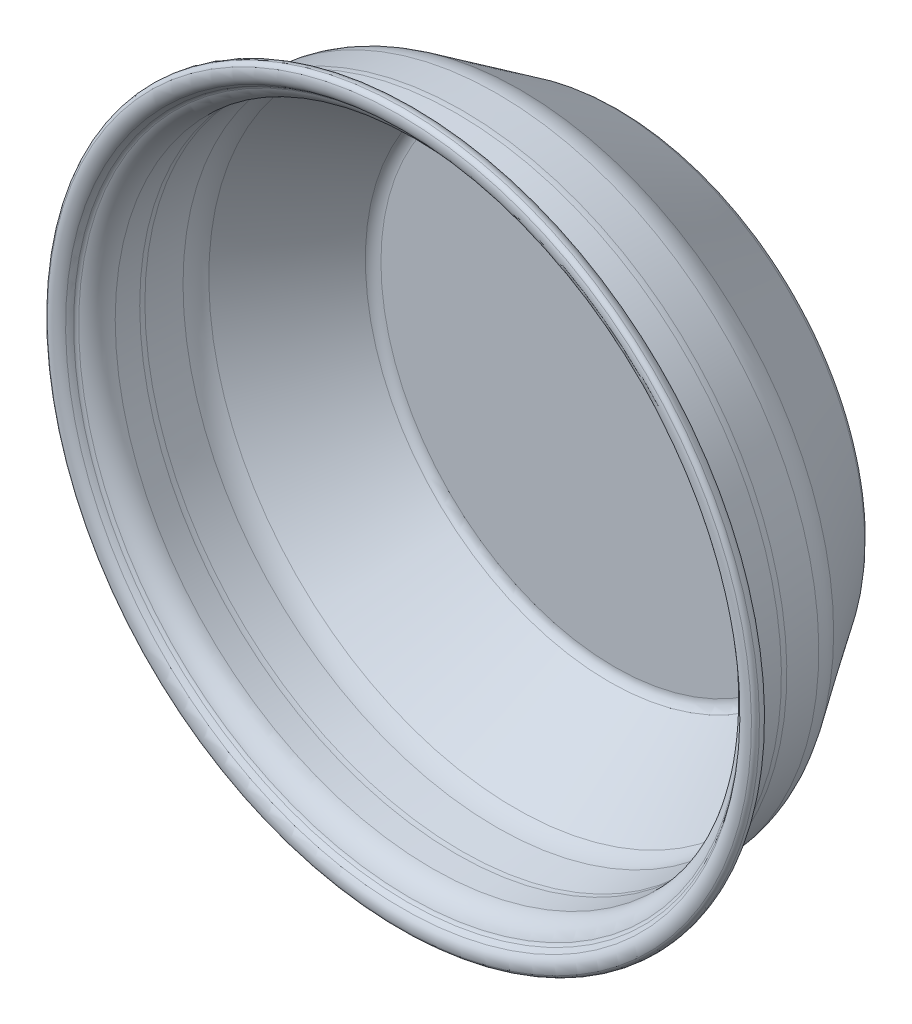
ISO-10303-21;
HEADER;
FILE_DESCRIPTION(('STEP AP214'),'2;1');
FILE_NAME('part.step','',(''),(''),'','','');
FILE_SCHEMA(('AUTOMOTIVE_DESIGN { 1 0 10303 214 1 1 1 1 }'));
ENDSEC;
DATA;
#1=APPLICATION_CONTEXT('core data for automotive mechanical design processes');
#2=APPLICATION_PROTOCOL_DEFINITION('international standard','automotive_design',2000,#1);
#3=PRODUCT_CONTEXT('',#1,'mechanical');
#4=PRODUCT('Part','Part','',(#3));
#5=PRODUCT_RELATED_PRODUCT_CATEGORY('part','',(#4));
#6=PRODUCT_DEFINITION_FORMATION('','',#4);
#7=PRODUCT_DEFINITION_CONTEXT('part definition',#1,'design');
#8=PRODUCT_DEFINITION('design','',#6,#7);
#9=PRODUCT_DEFINITION_SHAPE('','',#8);
#10=(LENGTH_UNIT() NAMED_UNIT(*) SI_UNIT(.MILLI.,.METRE.));
#11=(NAMED_UNIT(*) PLANE_ANGLE_UNIT() SI_UNIT($,.RADIAN.));
#12=(NAMED_UNIT(*) SI_UNIT($,.STERADIAN.) SOLID_ANGLE_UNIT());
#13=UNCERTAINTY_MEASURE_WITH_UNIT(LENGTH_MEASURE(1.E-05),#10,'distance_accuracy_value','');
#14=(GEOMETRIC_REPRESENTATION_CONTEXT(3) GLOBAL_UNCERTAINTY_ASSIGNED_CONTEXT((#13)) GLOBAL_UNIT_ASSIGNED_CONTEXT((#10,
#11,#12)) REPRESENTATION_CONTEXT('',''));
#15=CARTESIAN_POINT('',(0.,0.,0.));
#16=DIRECTION('',(0.,0.,1.));
#17=DIRECTION('',(1.,0.,0.));
#18=AXIS2_PLACEMENT_3D('',#15,#16,#17);
#19=CARTESIAN_POINT('',(0.,0.,0.));
#20=DIRECTION('',(0.,0.,-1.));
#21=DIRECTION('',(0.,1.,0.));
#22=AXIS2_PLACEMENT_3D('',#19,#20,#21);
#23=PLANE('',#22);
#24=CARTESIAN_POINT('',(0.,0.,0.));
#25=DIRECTION('',(0.,0.,-1.));
#26=DIRECTION('',(0.,1.,0.));
#27=AXIS2_PLACEMENT_3D('',#24,#25,#26);
#28=CIRCLE('',#27,91.186);
#29=CARTESIAN_POINT('',(0.,91.186,0.));
#30=VERTEX_POINT('',#29);
#31=EDGE_CURVE('E10',#30,#30,#28,.T.);
#32=ORIENTED_EDGE('',*,*,#31,.T.);
#33=EDGE_LOOP('',(#32));
#34=FACE_BOUND('',#33,.T.);
#35=ADVANCED_FACE('F37',(#34),#23,.T.);
#36=CARTESIAN_POINT('',(0.,0.,7.93749999999999));
#37=DIRECTION('',(0.,0.,-1.));
#38=DIRECTION('',(0.,1.,0.));
#39=AXIS2_PLACEMENT_3D('',#36,#37,#38);
#40=TOROIDAL_SURFACE('',#39,91.186,7.9375);
#41=CARTESIAN_POINT('',(0.,0.,3.52381443996187));
#42=DIRECTION('',(0.,0.,-1.));
#43=DIRECTION('',(0.,1.,0.));
#44=AXIS2_PLACEMENT_3D('',#41,#42,#43);
#45=CIRCLE('',#44,97.7832180521119);
#46=CARTESIAN_POINT('',(0.,97.7832180521119,3.52381443996189));
#47=VERTEX_POINT('',#46);
#48=EDGE_CURVE('E43',#47,#47,#45,.T.);
#49=ORIENTED_EDGE('',*,*,#48,.T.);
#50=EDGE_LOOP('',(#49));
#51=FACE_BOUND('',#50,.T.);
#52=ORIENTED_EDGE('',*,*,#31,.F.);
#53=EDGE_LOOP('',(#52));
#54=FACE_BOUND('',#53,.T.);
#55=ADVANCED_FACE('F117',(#51,#54),#40,.T.);
#56=CARTESIAN_POINT('',(0.,0.,3.52381443996187));
#57=DIRECTION('',(0.,0.,1.));
#58=DIRECTION('',(0.,-1.,0.));
#59=AXIS2_PLACEMENT_3D('',#56,#57,#58);
#60=CONICAL_SURFACE('',#59,97.7832180521119,0.589631608525966);
#61=CARTESIAN_POINT('',(0.,0.,40.0894715552513));
#62=DIRECTION('',(0.,0.,-1.));
#63=DIRECTION('',(0.,1.,0.));
#64=AXIS2_PLACEMENT_3D('',#61,#62,#63);
#65=CIRCLE('',#64,122.246455666548);
#66=CARTESIAN_POINT('',(0.,122.246455666548,40.0894715552513));
#67=VERTEX_POINT('',#66);
#68=EDGE_CURVE('E47',#67,#67,#65,.T.);
#69=ORIENTED_EDGE('',*,*,#68,.T.);
#70=EDGE_LOOP('',(#69));
#71=FACE_BOUND('',#70,.T.);
#72=ORIENTED_EDGE('',*,*,#48,.F.);
#73=EDGE_LOOP('',(#72));
#74=FACE_BOUND('',#73,.T.);
#75=ADVANCED_FACE('F121',(#71,#74),#60,.T.);
#76=CARTESIAN_POINT('',(0.,0.,50.6823168993428));
#77=DIRECTION('',(0.,0.,-1.));
#78=DIRECTION('',(0.,1.,0.));
#79=AXIS2_PLACEMENT_3D('',#76,#77,#78);
#80=TOROIDAL_SURFACE('',#79,106.413132341479,19.05);
#81=CARTESIAN_POINT('',(0.,0.,49.022));
#82=DIRECTION('',(0.,0.,-1.));
#83=DIRECTION('',(0.,1.,0.));
#84=AXIS2_PLACEMENT_3D('',#81,#82,#83);
#85=CIRCLE('',#84,125.390641340127);
#86=CARTESIAN_POINT('',(0.,125.390641340127,49.022));
#87=VERTEX_POINT('',#86);
#88=EDGE_CURVE('E51',#87,#87,#85,.T.);
#89=ORIENTED_EDGE('',*,*,#88,.T.);
#90=EDGE_LOOP('',(#89));
#91=FACE_BOUND('',#90,.T.);
#92=ORIENTED_EDGE('',*,*,#68,.F.);
#93=EDGE_LOOP('',(#92));
#94=FACE_BOUND('',#93,.T.);
#95=ADVANCED_FACE('F125',(#91,#94),#80,.T.);
#96=CARTESIAN_POINT('',(0.,0.,49.022));
#97=DIRECTION('',(0.,0.,1.));
#98=DIRECTION('',(0.,-1.,0.));
#99=AXIS2_PLACEMENT_3D('',#96,#97,#98);
#100=CONICAL_SURFACE('',#99,125.390641340127,0.0872664625997091);
#101=CARTESIAN_POINT('',(0.,0.,62.6832441342097));
#102=DIRECTION('',(0.,0.,-1.));
#103=DIRECTION('',(0.,1.,0.));
#104=AXIS2_PLACEMENT_3D('',#101,#102,#103);
#105=CIRCLE('',#104,126.58584533153);
#106=CARTESIAN_POINT('',(0.,126.58584533153,62.6832441342097));
#107=VERTEX_POINT('',#106);
#108=EDGE_CURVE('E56',#107,#107,#105,.T.);
#109=ORIENTED_EDGE('',*,*,#108,.T.);
#110=EDGE_LOOP('',(#109));
#111=FACE_BOUND('',#110,.T.);
#112=ORIENTED_EDGE('',*,*,#88,.F.);
#113=EDGE_LOOP('',(#112));
#114=FACE_BOUND('',#113,.T.);
#115=ADVANCED_FACE('F132',(#111,#114),#100,.T.);
#116=CARTESIAN_POINT('',(0.,0.,64.897));
#117=DIRECTION('',(0.,0.,-1.));
#118=DIRECTION('',(0.,1.,0.));
#119=AXIS2_PLACEMENT_3D('',#116,#117,#118);
#120=TOROIDAL_SURFACE('',#119,101.2825,25.4);
#121=CARTESIAN_POINT('',(0.,0.,64.897));
#122=DIRECTION('',(0.,0.,-1.));
#123=DIRECTION('',(0.,1.,0.));
#124=AXIS2_PLACEMENT_3D('',#121,#122,#123);
#125=CIRCLE('',#124,126.6825);
#126=CARTESIAN_POINT('',(0.,126.6825,64.897));
#127=VERTEX_POINT('',#126);
#128=EDGE_CURVE('E59',#127,#127,#125,.T.);
#129=ORIENTED_EDGE('',*,*,#128,.T.);
#130=EDGE_LOOP('',(#129));
#131=FACE_BOUND('',#130,.T.);
#132=ORIENTED_EDGE('',*,*,#108,.F.);
#133=EDGE_LOOP('',(#132));
#134=FACE_BOUND('',#133,.T.);
#135=ADVANCED_FACE('F136',(#131,#134),#120,.T.);
#136=CARTESIAN_POINT('',(0.,0.,0.));
#137=DIRECTION('',(0.,0.,-1.));
#138=DIRECTION('',(0.,1.,0.));
#139=AXIS2_PLACEMENT_3D('',#136,#137,#138);
#140=CYLINDRICAL_SURFACE('',#139,126.6825);
#141=CARTESIAN_POINT('',(0.,0.,74.453829774373));
#142=DIRECTION('',(0.,0.,-1.));
#143=DIRECTION('',(0.,1.,0.));
#144=AXIS2_PLACEMENT_3D('',#141,#142,#143);
#145=CIRCLE('',#144,126.6825);
#146=CARTESIAN_POINT('',(0.,126.6825,74.453829774373));
#147=VERTEX_POINT('',#146);
#148=EDGE_CURVE('E62',#147,#147,#145,.T.);
#149=ORIENTED_EDGE('',*,*,#148,.T.);
#150=EDGE_LOOP('',(#149));
#151=FACE_BOUND('',#150,.T.);
#152=ORIENTED_EDGE('',*,*,#128,.F.);
#153=EDGE_LOOP('',(#152));
#154=FACE_BOUND('',#153,.T.);
#155=ADVANCED_FACE('F140',(#151,#154),#140,.T.);
#156=CARTESIAN_POINT('',(0.,0.,74.453829774373));
#157=DIRECTION('',(0.,0.,-1.));
#158=DIRECTION('',(0.,1.,0.));
#159=AXIS2_PLACEMENT_3D('',#156,#157,#158);
#160=TOROIDAL_SURFACE('',#159,133.0325,6.34999999999999);
#161=CARTESIAN_POINT('',(0.,0.,80.772));
#162=DIRECTION('',(0.,0.,-1.));
#163=DIRECTION('',(0.,1.,0.));
#164=AXIS2_PLACEMENT_3D('',#161,#162,#163);
#165=CIRCLE('',#164,133.6675);
#166=CARTESIAN_POINT('',(0.,133.6675,80.772));
#167=VERTEX_POINT('',#166);
#168=EDGE_CURVE('E65',#167,#167,#165,.T.);
#169=ORIENTED_EDGE('',*,*,#168,.T.);
#170=EDGE_LOOP('',(#169));
#171=FACE_BOUND('',#170,.T.);
#172=ORIENTED_EDGE('',*,*,#148,.F.);
#173=EDGE_LOOP('',(#172));
#174=FACE_BOUND('',#173,.T.);
#175=ADVANCED_FACE('F144',(#171,#174),#160,.F.);
#176=CARTESIAN_POINT('',(0.,0.,85.1947191579389));
#177=DIRECTION('',(0.,0.,-1.));
#178=DIRECTION('',(0.,1.,0.));
#179=AXIS2_PLACEMENT_3D('',#176,#177,#178);
#180=TOROIDAL_SURFACE('',#179,134.112,4.44499999999997);
#181=CARTESIAN_POINT('',(0.,0.,85.3180246851131));
#182=DIRECTION('',(0.,0.,-1.));
#183=DIRECTION('',(0.,1.,0.));
#184=AXIS2_PLACEMENT_3D('',#181,#182,#183);
#185=CIRCLE('',#184,138.555289406168);
#186=CARTESIAN_POINT('',(0.,138.555289406168,85.3180246851131));
#187=VERTEX_POINT('',#186);
#188=EDGE_CURVE('E68',#187,#187,#185,.T.);
#189=ORIENTED_EDGE('',*,*,#188,.T.);
#190=EDGE_LOOP('',(#189));
#191=FACE_BOUND('',#190,.T.);
#192=ORIENTED_EDGE('',*,*,#168,.F.);
#193=EDGE_LOOP('',(#192));
#194=FACE_BOUND('',#193,.T.);
#195=ADVANCED_FACE('F148',(#191,#194),#180,.T.);
#196=CARTESIAN_POINT('',(0.,0.,85.2616564441192));
#197=DIRECTION('',(0.,0.,-1.));
#198=DIRECTION('',(0.,1.,0.));
#199=AXIS2_PLACEMENT_3D('',#196,#197,#198);
#200=TOROIDAL_SURFACE('',#199,136.52407139192,2.03199999999996);
#201=CARTESIAN_POINT('',(0.,0.,87.1538297743729));
#202=DIRECTION('',(0.,0.,-1.));
#203=DIRECTION('',(0.,1.,0.));
#204=AXIS2_PLACEMENT_3D('',#201,#202,#203);
#205=CIRCLE('',#204,137.26481702186);
#206=CARTESIAN_POINT('',(0.,137.26481702186,87.1538297743729));
#207=VERTEX_POINT('',#206);
#208=EDGE_CURVE('E71',#207,#207,#205,.T.);
#209=ORIENTED_EDGE('',*,*,#208,.T.);
#210=EDGE_LOOP('',(#209));
#211=FACE_BOUND('',#210,.T.);
#212=ORIENTED_EDGE('',*,*,#188,.F.);
#213=EDGE_LOOP('',(#212));
#214=FACE_BOUND('',#213,.T.);
#215=ADVANCED_FACE('F152',(#211,#214),#200,.T.);
#216=CARTESIAN_POINT('',(0.,0.,82.1868747824568));
#217=DIRECTION('',(0.,0.,-1.));
#218=DIRECTION('',(0.,1.,0.));
#219=AXIS2_PLACEMENT_3D('',#216,#217,#218);
#220=TOROIDAL_SURFACE('',#219,135.320359743266,5.334);
#221=CARTESIAN_POINT('',(0.,0.,85.852));
#222=DIRECTION('',(0.,0.,-1.));
#223=DIRECTION('',(0.,1.,0.));
#224=AXIS2_PLACEMENT_3D('',#221,#222,#223);
#225=CIRCLE('',#224,131.445);
#226=CARTESIAN_POINT('',(0.,131.445,85.852));
#227=VERTEX_POINT('',#226);
#228=EDGE_CURVE('E74',#227,#227,#225,.T.);
#229=ORIENTED_EDGE('',*,*,#228,.T.);
#230=EDGE_LOOP('',(#229));
#231=FACE_BOUND('',#230,.T.);
#232=ORIENTED_EDGE('',*,*,#208,.F.);
#233=EDGE_LOOP('',(#232));
#234=FACE_BOUND('',#233,.T.);
#235=ADVANCED_FACE('F156',(#231,#234),#220,.T.);
#236=CARTESIAN_POINT('',(0.,0.,79.3071335401014));
#237=DIRECTION('',(0.,0.,-1.));
#238=DIRECTION('',(0.,1.,0.));
#239=AXIS2_PLACEMENT_3D('',#236,#237,#238);
#240=TOROIDAL_SURFACE('',#239,138.365285255832,9.525);
#241=CARTESIAN_POINT('',(0.,0.,84.0583722616098));
#242=DIRECTION('',(0.,0.,-1.));
#243=DIRECTION('',(0.,1.,0.));
#244=AXIS2_PLACEMENT_3D('',#241,#242,#243);
#245=CIRCLE('',#244,130.109901823717);
#246=CARTESIAN_POINT('',(0.,130.109901823717,84.0583722616098));
#247=VERTEX_POINT('',#246);
#248=EDGE_CURVE('E77',#247,#247,#245,.T.);
#249=ORIENTED_EDGE('',*,*,#248,.T.);
#250=EDGE_LOOP('',(#249));
#251=FACE_BOUND('',#250,.T.);
#252=ORIENTED_EDGE('',*,*,#228,.F.);
#253=EDGE_LOOP('',(#252));
#254=FACE_BOUND('',#253,.T.);
#255=ADVANCED_FACE('F160',(#251,#254),#240,.T.);
#256=CARTESIAN_POINT('',(0.,0.,85.1986695547718));
#257=DIRECTION('',(0.,0.,-1.));
#258=DIRECTION('',(0.,1.,0.));
#259=AXIS2_PLACEMENT_3D('',#256,#257,#258);
#260=TOROIDAL_SURFACE('',#259,128.12860980001,2.28600000000001);
#261=CARTESIAN_POINT('',(0.,0.,83.1190231456624));
#262=DIRECTION('',(0.,0.,-1.));
#263=DIRECTION('',(0.,1.,0.));
#264=AXIS2_PLACEMENT_3D('',#261,#262,#263);
#265=CIRCLE('',#264,129.077749838717);
#266=CARTESIAN_POINT('',(0.,129.077749838717,83.1190231456624));
#267=VERTEX_POINT('',#266);
#268=EDGE_CURVE('E80',#267,#267,#265,.T.);
#269=ORIENTED_EDGE('',*,*,#268,.T.);
#270=EDGE_LOOP('',(#269));
#271=FACE_BOUND('',#270,.T.);
#272=ORIENTED_EDGE('',*,*,#248,.F.);
#273=EDGE_LOOP('',(#272));
#274=FACE_BOUND('',#273,.T.);
#275=ADVANCED_FACE('F164',(#271,#274),#260,.F.);
#276=CARTESIAN_POINT('',(0.,0.,74.453829774373));
#277=DIRECTION('',(0.,0.,-1.));
#278=DIRECTION('',(0.,1.,0.));
#279=AXIS2_PLACEMENT_3D('',#276,#277,#278);
#280=TOROIDAL_SURFACE('',#279,133.0325,9.52499999999998);
#281=CARTESIAN_POINT('',(0.,0.,74.453829774373));
#282=DIRECTION('',(0.,0.,-1.));
#283=DIRECTION('',(0.,1.,0.));
#284=AXIS2_PLACEMENT_3D('',#281,#282,#283);
#285=CIRCLE('',#284,123.5075);
#286=CARTESIAN_POINT('',(0.,123.5075,74.453829774373));
#287=VERTEX_POINT('',#286);
#288=EDGE_CURVE('E83',#287,#287,#285,.T.);
#289=ORIENTED_EDGE('',*,*,#288,.T.);
#290=EDGE_LOOP('',(#289));
#291=FACE_BOUND('',#290,.T.);
#292=ORIENTED_EDGE('',*,*,#268,.F.);
#293=EDGE_LOOP('',(#292));
#294=FACE_BOUND('',#293,.T.);
#295=ADVANCED_FACE('F168',(#291,#294),#280,.T.);
#296=CARTESIAN_POINT('',(0.,0.,0.));
#297=DIRECTION('',(0.,0.,-1.));
#298=DIRECTION('',(0.,1.,0.));
#299=AXIS2_PLACEMENT_3D('',#296,#297,#298);
#300=CYLINDRICAL_SURFACE('',#299,123.5075);
#301=CARTESIAN_POINT('',(0.,0.,64.897));
#302=DIRECTION('',(0.,0.,-1.));
#303=DIRECTION('',(0.,1.,0.));
#304=AXIS2_PLACEMENT_3D('',#301,#302,#303);
#305=CIRCLE('',#304,123.5075);
#306=CARTESIAN_POINT('',(0.,123.5075,64.897));
#307=VERTEX_POINT('',#306);
#308=EDGE_CURVE('E86',#307,#307,#305,.T.);
#309=ORIENTED_EDGE('',*,*,#308,.T.);
#310=EDGE_LOOP('',(#309));
#311=FACE_BOUND('',#310,.T.);
#312=ORIENTED_EDGE('',*,*,#288,.F.);
#313=EDGE_LOOP('',(#312));
#314=FACE_BOUND('',#313,.T.);
#315=ADVANCED_FACE('F172',(#311,#314),#300,.F.);
#316=CARTESIAN_POINT('',(0.,0.,64.897));
#317=DIRECTION('',(0.,0.,-1.));
#318=DIRECTION('',(0.,1.,0.));
#319=AXIS2_PLACEMENT_3D('',#316,#317,#318);
#320=TOROIDAL_SURFACE('',#319,101.2825,22.225);
#321=CARTESIAN_POINT('',(0.,0.,62.9599636174335));
#322=DIRECTION('',(0.,0.,-1.));
#323=DIRECTION('',(0.,1.,0.));
#324=AXIS2_PLACEMENT_3D('',#321,#322,#323);
#325=CIRCLE('',#324,123.422927165089);
#326=CARTESIAN_POINT('',(0.,123.422927165089,62.9599636174335));
#327=VERTEX_POINT('',#326);
#328=EDGE_CURVE('E89',#327,#327,#325,.T.);
#329=ORIENTED_EDGE('',*,*,#328,.T.);
#330=EDGE_LOOP('',(#329));
#331=FACE_BOUND('',#330,.T.);
#332=ORIENTED_EDGE('',*,*,#308,.F.);
#333=EDGE_LOOP('',(#332));
#334=FACE_BOUND('',#333,.T.);
#335=ADVANCED_FACE('F176',(#331,#334),#320,.F.);
#336=CARTESIAN_POINT('',(0.,0.,62.9599636174335));
#337=DIRECTION('',(0.,0.,1.));
#338=DIRECTION('',(0.,-1.,0.));
#339=AXIS2_PLACEMENT_3D('',#336,#337,#338);
#340=CONICAL_SURFACE('',#339,123.422927165089,0.0872664625997091);
#341=CARTESIAN_POINT('',(0.,0.,49.2987194832238));
#342=DIRECTION('',(0.,0.,-1.));
#343=DIRECTION('',(0.,1.,0.));
#344=AXIS2_PLACEMENT_3D('',#341,#342,#343);
#345=CIRCLE('',#344,122.227723173685);
#346=CARTESIAN_POINT('',(0.,122.227723173685,49.2987194832238));
#347=VERTEX_POINT('',#346);
#348=EDGE_CURVE('E92',#347,#347,#345,.T.);
#349=ORIENTED_EDGE('',*,*,#348,.T.);
#350=EDGE_LOOP('',(#349));
#351=FACE_BOUND('',#350,.T.);
#352=ORIENTED_EDGE('',*,*,#328,.F.);
#353=EDGE_LOOP('',(#352));
#354=FACE_BOUND('',#353,.T.);
#355=ADVANCED_FACE('F180',(#351,#354),#340,.F.);
#356=CARTESIAN_POINT('',(0.,0.,50.6823168993428));
#357=DIRECTION('',(0.,0.,-1.));
#358=DIRECTION('',(0.,1.,0.));
#359=AXIS2_PLACEMENT_3D('',#356,#357,#358);
#360=TOROIDAL_SURFACE('',#359,106.413132341479,15.875);
#361=CARTESIAN_POINT('',(0.,0.,41.8549457792665));
#362=DIRECTION('',(0.,0.,-1.));
#363=DIRECTION('',(0.,1.,0.));
#364=AXIS2_PLACEMENT_3D('',#361,#362,#363);
#365=CIRCLE('',#364,119.607568445703);
#366=CARTESIAN_POINT('',(0.,119.607568445703,41.8549457792666));
#367=VERTEX_POINT('',#366);
#368=EDGE_CURVE('E95',#367,#367,#365,.T.);
#369=ORIENTED_EDGE('',*,*,#368,.T.);
#370=EDGE_LOOP('',(#369));
#371=FACE_BOUND('',#370,.T.);
#372=ORIENTED_EDGE('',*,*,#348,.F.);
#373=EDGE_LOOP('',(#372));
#374=FACE_BOUND('',#373,.T.);
#375=ADVANCED_FACE('F184',(#371,#374),#360,.F.);
#376=CARTESIAN_POINT('',(0.,0.,41.8549457792665));
#377=DIRECTION('',(0.,0.,1.));
#378=DIRECTION('',(0.,-1.,0.));
#379=AXIS2_PLACEMENT_3D('',#376,#377,#378);
#380=CONICAL_SURFACE('',#379,119.607568445703,0.589631608525966);
#381=CARTESIAN_POINT('',(0.,0.,5.28928866397712));
#382=DIRECTION('',(0.,0.,-1.));
#383=DIRECTION('',(0.,1.,0.));
#384=AXIS2_PLACEMENT_3D('',#381,#382,#383);
#385=CIRCLE('',#384,95.1443308312671);
#386=CARTESIAN_POINT('',(0.,95.1443308312671,5.28928866397714));
#387=VERTEX_POINT('',#386);
#388=EDGE_CURVE('E98',#387,#387,#385,.T.);
#389=ORIENTED_EDGE('',*,*,#388,.T.);
#390=EDGE_LOOP('',(#389));
#391=FACE_BOUND('',#390,.T.);
#392=ORIENTED_EDGE('',*,*,#368,.F.);
#393=EDGE_LOOP('',(#392));
#394=FACE_BOUND('',#393,.T.);
#395=ADVANCED_FACE('F114',(#391,#394),#380,.F.);
#396=CARTESIAN_POINT('',(0.,0.,7.93749999999999));
#397=DIRECTION('',(0.,0.,-1.));
#398=DIRECTION('',(0.,1.,0.));
#399=AXIS2_PLACEMENT_3D('',#396,#397,#398);
#400=TOROIDAL_SURFACE('',#399,91.186,4.7625);
#401=CARTESIAN_POINT('',(0.,0.,3.17499999999999));
#402=DIRECTION('',(0.,0.,-1.));
#403=DIRECTION('',(0.,1.,0.));
#404=AXIS2_PLACEMENT_3D('',#401,#402,#403);
#405=CIRCLE('',#404,91.186);
#406=CARTESIAN_POINT('',(0.,91.186,3.175));
#407=VERTEX_POINT('',#406);
#408=EDGE_CURVE('E101',#407,#407,#405,.T.);
#409=ORIENTED_EDGE('',*,*,#408,.T.);
#410=EDGE_LOOP('',(#409));
#411=FACE_BOUND('',#410,.T.);
#412=ORIENTED_EDGE('',*,*,#388,.F.);
#413=EDGE_LOOP('',(#412));
#414=FACE_BOUND('',#413,.T.);
#415=ADVANCED_FACE('F105',(#411,#414),#400,.F.);
#416=CARTESIAN_POINT('',(0.,0.,3.175));
#417=DIRECTION('',(0.,0.,1.));
#418=DIRECTION('',(0.,-1.,0.));
#419=AXIS2_PLACEMENT_3D('',#416,#417,#418);
#420=PLANE('',#419);
#421=ORIENTED_EDGE('',*,*,#408,.F.);
#422=EDGE_LOOP('',(#421));
#423=FACE_BOUND('',#422,.T.);
#424=ADVANCED_FACE('F108',(#423),#420,.T.);
#425=CLOSED_SHELL('',(#35,#55,#75,#95,#115,#135,#155,#175,#195,#215,#235,#255,#275,#295,#315,
#335,#355,#375,#395,#415,#424));
#426=MANIFOLD_SOLID_BREP('B2',#425);
#427=ADVANCED_BREP_SHAPE_REPRESENTATION('',(#18,#426),#14);
#428=SHAPE_DEFINITION_REPRESENTATION(#9,#427);
ENDSEC;
END-ISO-10303-21;
